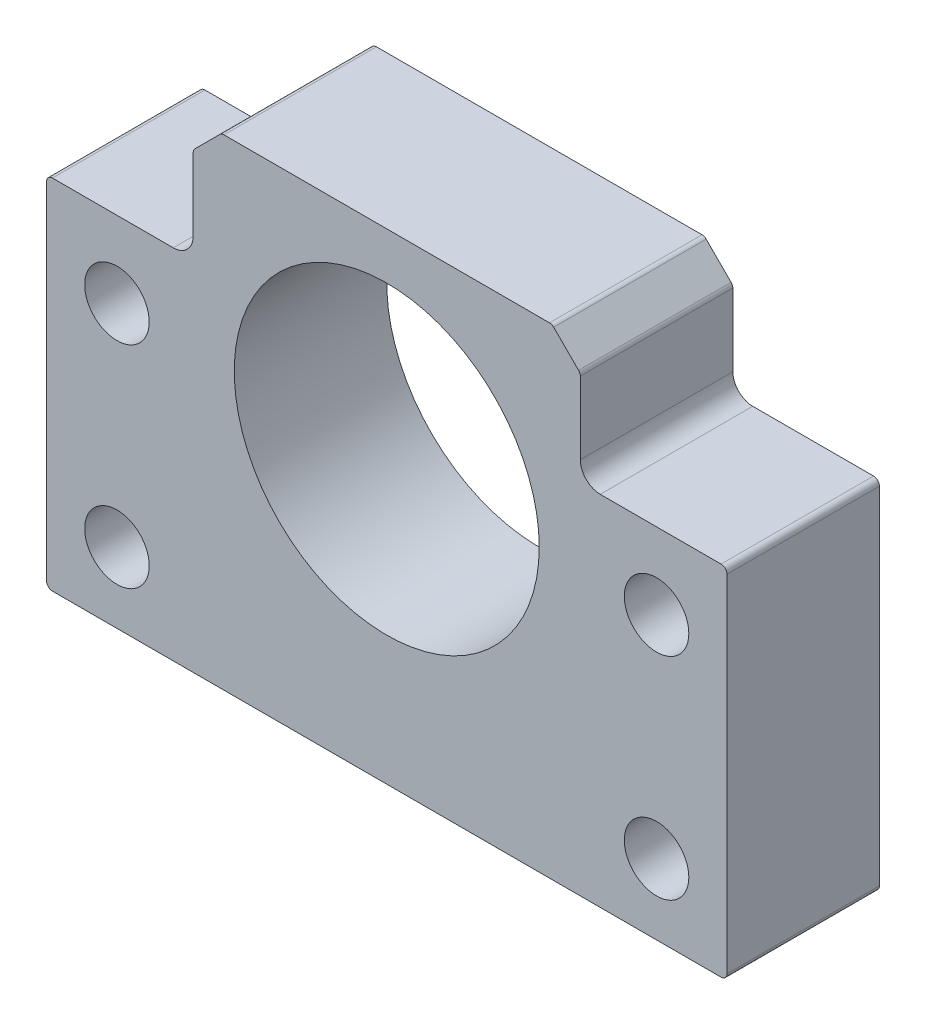
ISO-10303-21;
HEADER;
FILE_DESCRIPTION(('STEP AP214'),'2;1');
FILE_NAME('part.step','',(''),(''),'','','');
FILE_SCHEMA(('AUTOMOTIVE_DESIGN { 1 0 10303 214 1 1 1 1 }'));
ENDSEC;
DATA;
#1=APPLICATION_CONTEXT('core data for automotive mechanical design processes');
#2=APPLICATION_PROTOCOL_DEFINITION('international standard','automotive_design',2000,#1);
#3=PRODUCT_CONTEXT('',#1,'mechanical');
#4=PRODUCT('Part','Part','',(#3));
#5=PRODUCT_RELATED_PRODUCT_CATEGORY('part','',(#4));
#6=PRODUCT_DEFINITION_FORMATION('','',#4);
#7=PRODUCT_DEFINITION_CONTEXT('part definition',#1,'design');
#8=PRODUCT_DEFINITION('design','',#6,#7);
#9=PRODUCT_DEFINITION_SHAPE('','',#8);
#10=(LENGTH_UNIT() NAMED_UNIT(*) SI_UNIT(.MILLI.,.METRE.));
#11=(NAMED_UNIT(*) PLANE_ANGLE_UNIT() SI_UNIT($,.RADIAN.));
#12=(NAMED_UNIT(*) SI_UNIT($,.STERADIAN.) SOLID_ANGLE_UNIT());
#13=UNCERTAINTY_MEASURE_WITH_UNIT(LENGTH_MEASURE(1.E-05),#10,'distance_accuracy_value','');
#14=(GEOMETRIC_REPRESENTATION_CONTEXT(3) GLOBAL_UNCERTAINTY_ASSIGNED_CONTEXT((#13)) GLOBAL_UNIT_ASSIGNED_CONTEXT((#10,
#11,#12)) REPRESENTATION_CONTEXT('',''));
#15=CARTESIAN_POINT('',(0.,0.,0.));
#16=DIRECTION('',(0.,0.,1.));
#17=DIRECTION('',(1.,0.,0.));
#18=AXIS2_PLACEMENT_3D('',#15,#16,#17);
#19=CARTESIAN_POINT('',(0.,0.,13.));
#20=DIRECTION('',(0.,0.,1.));
#21=DIRECTION('',(1.,0.,0.));
#22=AXIS2_PLACEMENT_3D('',#19,#20,#21);
#23=PLANE('',#22);
#24=CARTESIAN_POINT('',(-11.9720303017953,-9.80301608638184,13.));
#25=DIRECTION('',(0.,0.,1.));
#26=DIRECTION('',(1.,0.,0.));
#27=AXIS2_PLACEMENT_3D('',#24,#25,#26);
#28=CIRCLE('',#27,2.75);
#29=CARTESIAN_POINT('',(-9.22203030179525,-9.80301608638184,13.));
#30=VERTEX_POINT('',#29);
#31=EDGE_CURVE('E658',#30,#30,#28,.T.);
#32=ORIENTED_EDGE('',*,*,#31,.F.);
#33=EDGE_LOOP('',(#32));
#34=FACE_BOUND('',#33,.T.);
#35=CARTESIAN_POINT('',(34.0279696982047,8.19698391361817,13.));
#36=DIRECTION('',(0.,0.,1.));
#37=DIRECTION('',(1.,0.,0.));
#38=AXIS2_PLACEMENT_3D('',#35,#36,#37);
#39=CIRCLE('',#38,2.74999999999999);
#40=CARTESIAN_POINT('',(36.7779696982047,8.19698391361817,13.));
#41=VERTEX_POINT('',#40);
#42=EDGE_CURVE('E343',#41,#41,#39,.T.);
#43=ORIENTED_EDGE('',*,*,#42,.F.);
#44=EDGE_LOOP('',(#43));
#45=FACE_BOUND('',#44,.T.);
#46=DIRECTION('',(-1.,0.,0.));
#47=VECTOR('',#46,1.);
#48=CARTESIAN_POINT('',(-5.47203030179526,14.6969839136182,13.));
#49=LINE('',#48,#47);
#50=CARTESIAN_POINT('',(-7.17203030179526,14.6969839136182,13.));
#51=VERTEX_POINT('',#50);
#52=CARTESIAN_POINT('',(-17.4720303017952,14.6969839136182,13.));
#53=VERTEX_POINT('',#52);
#54=EDGE_CURVE('E322',#51,#53,#49,.T.);
#55=ORIENTED_EDGE('',*,*,#54,.T.);
#56=CARTESIAN_POINT('',(-17.4720303017952,14.1969839136182,13.));
#57=DIRECTION('',(0.,0.,1.));
#58=DIRECTION('',(1.,0.,0.));
#59=AXIS2_PLACEMENT_3D('',#56,#57,#58);
#60=CIRCLE('',#59,0.5);
#61=CARTESIAN_POINT('',(-17.9720303017952,14.1969839136182,13.));
#62=VERTEX_POINT('',#61);
#63=EDGE_CURVE('E273',#53,#62,#60,.T.);
#64=ORIENTED_EDGE('',*,*,#63,.T.);
#65=DIRECTION('',(0.,-1.,0.));
#66=VECTOR('',#65,1.);
#67=CARTESIAN_POINT('',(-17.9720303017952,14.6969839136182,13.));
#68=LINE('',#67,#66);
#69=CARTESIAN_POINT('',(-17.9720303017952,-15.3030160863818,13.));
#70=VERTEX_POINT('',#69);
#71=EDGE_CURVE('E325',#62,#70,#68,.T.);
#72=ORIENTED_EDGE('',*,*,#71,.T.);
#73=CARTESIAN_POINT('',(-17.4720303017952,-15.3030160863818,13.));
#74=DIRECTION('',(0.,0.,1.));
#75=DIRECTION('',(1.,0.,0.));
#76=AXIS2_PLACEMENT_3D('',#73,#74,#75);
#77=CIRCLE('',#76,0.5);
#78=CARTESIAN_POINT('',(-17.4720303017952,-15.8030160863818,13.));
#79=VERTEX_POINT('',#78);
#80=EDGE_CURVE('E54',#70,#79,#77,.T.);
#81=ORIENTED_EDGE('',*,*,#80,.T.);
#82=DIRECTION('',(1.,0.,0.));
#83=VECTOR('',#82,1.);
#84=CARTESIAN_POINT('',(-17.9720303017952,-15.8030160863818,13.));
#85=LINE('',#84,#83);
#86=CARTESIAN_POINT('',(39.5279696982047,-15.8030160863818,13.));
#87=VERTEX_POINT('',#86);
#88=EDGE_CURVE('E193',#79,#87,#85,.T.);
#89=ORIENTED_EDGE('',*,*,#88,.T.);
#90=CARTESIAN_POINT('',(39.5279696982047,-15.3030160863818,13.));
#91=DIRECTION('',(0.,0.,1.));
#92=DIRECTION('',(1.,0.,0.));
#93=AXIS2_PLACEMENT_3D('',#90,#91,#92);
#94=CIRCLE('',#93,0.5);
#95=CARTESIAN_POINT('',(40.0279696982047,-15.3030160863818,13.));
#96=VERTEX_POINT('',#95);
#97=EDGE_CURVE('E270',#87,#96,#94,.T.);
#98=ORIENTED_EDGE('',*,*,#97,.T.);
#99=DIRECTION('',(0.,1.,0.));
#100=VECTOR('',#99,1.);
#101=CARTESIAN_POINT('',(40.0279696982047,-15.8030160863818,13.));
#102=LINE('',#101,#100);
#103=CARTESIAN_POINT('',(40.0279696982047,14.1969839136182,13.));
#104=VERTEX_POINT('',#103);
#105=EDGE_CURVE('E224',#96,#104,#102,.T.);
#106=ORIENTED_EDGE('',*,*,#105,.T.);
#107=CARTESIAN_POINT('',(39.5279696982047,14.1969839136182,13.));
#108=DIRECTION('',(0.,0.,1.));
#109=DIRECTION('',(1.,0.,0.));
#110=AXIS2_PLACEMENT_3D('',#107,#108,#109);
#111=CIRCLE('',#110,0.5);
#112=CARTESIAN_POINT('',(39.5279696982047,14.6969839136182,13.));
#113=VERTEX_POINT('',#112);
#114=EDGE_CURVE('E268',#104,#113,#111,.T.);
#115=ORIENTED_EDGE('',*,*,#114,.T.);
#116=DIRECTION('',(-1.,0.,0.));
#117=VECTOR('',#116,1.);
#118=CARTESIAN_POINT('',(40.0279696982047,14.6969839136182,13.));
#119=LINE('',#118,#117);
#120=CARTESIAN_POINT('',(29.2279696982048,14.6969839136182,13.));
#121=VERTEX_POINT('',#120);
#122=EDGE_CURVE('E351',#113,#121,#119,.T.);
#123=ORIENTED_EDGE('',*,*,#122,.T.);
#124=CARTESIAN_POINT('',(29.2279696982048,16.3969839136182,13.));
#125=DIRECTION('',(0.,0.,1.));
#126=DIRECTION('',(1.,0.,0.));
#127=AXIS2_PLACEMENT_3D('',#124,#125,#126);
#128=CIRCLE('',#127,1.7);
#129=CARTESIAN_POINT('',(27.5279696982048,16.3969839136182,13.));
#130=VERTEX_POINT('',#129);
#131=EDGE_CURVE('E182',#121,#130,#128,.F.);
#132=ORIENTED_EDGE('',*,*,#131,.T.);
#133=DIRECTION('',(0.,1.,0.));
#134=VECTOR('',#133,1.);
#135=CARTESIAN_POINT('',(27.5279696982048,14.6969839136182,13.));
#136=LINE('',#135,#134);
#137=CARTESIAN_POINT('',(27.5279696982048,22.5756635700586,13.));
#138=VERTEX_POINT('',#137);
#139=EDGE_CURVE('E192',#130,#138,#136,.T.);
#140=ORIENTED_EDGE('',*,*,#139,.T.);
#141=CARTESIAN_POINT('',(27.0279696982048,22.5756635700586,13.));
#142=DIRECTION('',(0.,0.,1.));
#143=DIRECTION('',(1.,0.,0.));
#144=AXIS2_PLACEMENT_3D('',#141,#142,#143);
#145=CIRCLE('',#144,0.5);
#146=CARTESIAN_POINT('',(27.3815230887981,22.9292169606519,13.));
#147=VERTEX_POINT('',#146);
#148=EDGE_CURVE('E266',#138,#147,#145,.T.);
#149=ORIENTED_EDGE('',*,*,#148,.T.);
#150=DIRECTION('',(-0.70710678118656,0.707106781186535,0.));
#151=VECTOR('',#150,1.);
#152=CARTESIAN_POINT('',(27.5279696982048,22.7827703512452,13.));
#153=LINE('',#152,#151);
#154=CARTESIAN_POINT('',(25.2602027452384,25.0505373042115,13.));
#155=VERTEX_POINT('',#154);
#156=EDGE_CURVE('E354',#147,#155,#153,.T.);
#157=ORIENTED_EDGE('',*,*,#156,.T.);
#158=CARTESIAN_POINT('',(24.9066493546451,24.6969839136182,13.));
#159=DIRECTION('',(0.,0.,1.));
#160=DIRECTION('',(1.,0.,0.));
#161=AXIS2_PLACEMENT_3D('',#158,#159,#160);
#162=CIRCLE('',#161,0.5);
#163=CARTESIAN_POINT('',(24.9066493546451,25.1969839136182,13.));
#164=VERTEX_POINT('',#163);
#165=EDGE_CURVE('E264',#155,#164,#162,.T.);
#166=ORIENTED_EDGE('',*,*,#165,.T.);
#167=DIRECTION('',(-1.,0.,0.));
#168=VECTOR('',#167,1.);
#169=CARTESIAN_POINT('',(25.1137561358317,25.1969839136182,13.));
#170=LINE('',#169,#168);
#171=CARTESIAN_POINT('',(-2.85070995823559,25.1969839136182,13.));
#172=VERTEX_POINT('',#171);
#173=EDGE_CURVE('E327',#164,#172,#170,.T.);
#174=ORIENTED_EDGE('',*,*,#173,.T.);
#175=CARTESIAN_POINT('',(-2.8507099582356,24.6969839136182,13.));
#176=DIRECTION('',(0.,0.,1.));
#177=DIRECTION('',(1.,0.,0.));
#178=AXIS2_PLACEMENT_3D('',#175,#176,#177);
#179=CIRCLE('',#178,0.5);
#180=CARTESIAN_POINT('',(-3.20426334882887,25.0505373042115,13.));
#181=VERTEX_POINT('',#180);
#182=EDGE_CURVE('E262',#172,#181,#179,.T.);
#183=ORIENTED_EDGE('',*,*,#182,.T.);
#184=DIRECTION('',(-0.707106781186547,-0.707106781186548,0.));
#185=VECTOR('',#184,1.);
#186=CARTESIAN_POINT('',(-3.05781673942215,25.1969839136182,13.));
#187=LINE('',#186,#185);
#188=CARTESIAN_POINT('',(-5.32558369238856,22.9292169606518,13.));
#189=VERTEX_POINT('',#188);
#190=EDGE_CURVE('E308',#181,#189,#187,.T.);
#191=ORIENTED_EDGE('',*,*,#190,.T.);
#192=CARTESIAN_POINT('',(-4.97203030179529,22.5756635700585,13.));
#193=DIRECTION('',(0.,0.,1.));
#194=DIRECTION('',(1.,0.,0.));
#195=AXIS2_PLACEMENT_3D('',#192,#193,#194);
#196=CIRCLE('',#195,0.5);
#197=CARTESIAN_POINT('',(-5.47203030179529,22.5756635700585,13.));
#198=VERTEX_POINT('',#197);
#199=EDGE_CURVE('E260',#189,#198,#196,.T.);
#200=ORIENTED_EDGE('',*,*,#199,.T.);
#201=DIRECTION('',(0.,-1.,0.));
#202=VECTOR('',#201,1.);
#203=CARTESIAN_POINT('',(-5.47203030179529,22.7827703512451,13.));
#204=LINE('',#203,#202);
#205=CARTESIAN_POINT('',(-5.47203030179526,16.3969839136182,13.));
#206=VERTEX_POINT('',#205);
#207=EDGE_CURVE('E319',#198,#206,#204,.T.);
#208=ORIENTED_EDGE('',*,*,#207,.T.);
#209=CARTESIAN_POINT('',(-7.17203030179526,16.3969839136182,13.));
#210=DIRECTION('',(0.,0.,1.));
#211=DIRECTION('',(1.,0.,0.));
#212=AXIS2_PLACEMENT_3D('',#209,#210,#211);
#213=CIRCLE('',#212,1.7);
#214=EDGE_CURVE('E236',#206,#51,#213,.F.);
#215=ORIENTED_EDGE('',*,*,#214,.T.);
#216=EDGE_LOOP('',(#55,#64,#72,#81,#89,#98,#106,#115,#123,#132,#140,#149,#157,#166,#174,#183,
#191,#200,#208,#215));
#217=FACE_BOUND('',#216,.T.);
#218=CARTESIAN_POINT('',(11.0279696982047,8.19698391361817,13.));
#219=DIRECTION('',(0.,0.,1.));
#220=DIRECTION('',(1.,0.,0.));
#221=AXIS2_PLACEMENT_3D('',#218,#219,#220);
#222=CIRCLE('',#221,13.);
#223=CARTESIAN_POINT('',(24.0279696982047,8.19698391361817,13.));
#224=VERTEX_POINT('',#223);
#225=EDGE_CURVE('E333',#224,#224,#222,.T.);
#226=ORIENTED_EDGE('',*,*,#225,.F.);
#227=EDGE_LOOP('',(#226));
#228=FACE_BOUND('',#227,.T.);
#229=CARTESIAN_POINT('',(34.0279696982047,-9.80301608638184,13.));
#230=DIRECTION('',(0.,0.,1.));
#231=DIRECTION('',(1.,0.,0.));
#232=AXIS2_PLACEMENT_3D('',#229,#230,#231);
#233=CIRCLE('',#232,2.74999999999999);
#234=CARTESIAN_POINT('',(36.7779696982047,-9.80301608638184,13.));
#235=VERTEX_POINT('',#234);
#236=EDGE_CURVE('E662',#235,#235,#233,.T.);
#237=ORIENTED_EDGE('',*,*,#236,.F.);
#238=EDGE_LOOP('',(#237));
#239=FACE_BOUND('',#238,.T.);
#240=CARTESIAN_POINT('',(-11.9720303017953,8.19698391361817,13.));
#241=DIRECTION('',(0.,0.,1.));
#242=DIRECTION('',(1.,0.,0.));
#243=AXIS2_PLACEMENT_3D('',#240,#241,#242);
#244=CIRCLE('',#243,2.75);
#245=CARTESIAN_POINT('',(-9.22203030179525,8.19698391361817,13.));
#246=VERTEX_POINT('',#245);
#247=EDGE_CURVE('E653',#246,#246,#244,.T.);
#248=ORIENTED_EDGE('',*,*,#247,.F.);
#249=EDGE_LOOP('',(#248));
#250=FACE_BOUND('',#249,.T.);
#251=ADVANCED_FACE('F32',(#34,#45,#217,#228,#239,#250),#23,.T.);
#252=CARTESIAN_POINT('',(0.,0.,0.));
#253=DIRECTION('',(0.,0.,1.));
#254=DIRECTION('',(1.,0.,0.));
#255=AXIS2_PLACEMENT_3D('',#252,#253,#254);
#256=PLANE('',#255);
#257=DIRECTION('',(0.,-1.,0.));
#258=VECTOR('',#257,1.);
#259=CARTESIAN_POINT('',(-17.9720303017952,14.6969839136182,0.));
#260=LINE('',#259,#258);
#261=CARTESIAN_POINT('',(-17.9720303017952,14.1969839136182,0.));
#262=VERTEX_POINT('',#261);
#263=CARTESIAN_POINT('',(-17.9720303017952,-15.3030160863818,0.));
#264=VERTEX_POINT('',#263);
#265=EDGE_CURVE('E220',#262,#264,#260,.T.);
#266=ORIENTED_EDGE('',*,*,#265,.F.);
#267=CARTESIAN_POINT('',(-17.4720303017952,14.1969839136182,0.));
#268=DIRECTION('',(0.,0.,1.));
#269=DIRECTION('',(1.,0.,0.));
#270=AXIS2_PLACEMENT_3D('',#267,#268,#269);
#271=CIRCLE('',#270,0.5);
#272=CARTESIAN_POINT('',(-17.4720303017952,14.6969839136182,0.));
#273=VERTEX_POINT('',#272);
#274=EDGE_CURVE('E256',#262,#273,#271,.F.);
#275=ORIENTED_EDGE('',*,*,#274,.T.);
#276=DIRECTION('',(-1.,0.,0.));
#277=VECTOR('',#276,1.);
#278=CARTESIAN_POINT('',(-5.47203030179526,14.6969839136182,0.));
#279=LINE('',#278,#277);
#280=CARTESIAN_POINT('',(-7.17203030179526,14.6969839136182,0.));
#281=VERTEX_POINT('',#280);
#282=EDGE_CURVE('E217',#281,#273,#279,.T.);
#283=ORIENTED_EDGE('',*,*,#282,.F.);
#284=CARTESIAN_POINT('',(-7.17203030179526,16.3969839136182,0.));
#285=DIRECTION('',(0.,0.,1.));
#286=DIRECTION('',(1.,0.,0.));
#287=AXIS2_PLACEMENT_3D('',#284,#285,#286);
#288=CIRCLE('',#287,1.7);
#289=CARTESIAN_POINT('',(-5.47203030179526,16.3969839136182,0.));
#290=VERTEX_POINT('',#289);
#291=EDGE_CURVE('E233',#281,#290,#288,.T.);
#292=ORIENTED_EDGE('',*,*,#291,.T.);
#293=DIRECTION('',(0.,-1.,0.));
#294=VECTOR('',#293,1.);
#295=CARTESIAN_POINT('',(-5.47203030179529,22.7827703512451,0.));
#296=LINE('',#295,#294);
#297=CARTESIAN_POINT('',(-5.47203030179529,22.5756635700585,0.));
#298=VERTEX_POINT('',#297);
#299=EDGE_CURVE('E215',#298,#290,#296,.T.);
#300=ORIENTED_EDGE('',*,*,#299,.F.);
#301=CARTESIAN_POINT('',(-4.97203030179529,22.5756635700585,0.));
#302=DIRECTION('',(0.,0.,1.));
#303=DIRECTION('',(1.,0.,0.));
#304=AXIS2_PLACEMENT_3D('',#301,#302,#303);
#305=CIRCLE('',#304,0.5);
#306=CARTESIAN_POINT('',(-5.32558369238856,22.9292169606518,0.));
#307=VERTEX_POINT('',#306);
#308=EDGE_CURVE('E243',#298,#307,#305,.F.);
#309=ORIENTED_EDGE('',*,*,#308,.T.);
#310=DIRECTION('',(-0.707106781186547,-0.707106781186548,0.));
#311=VECTOR('',#310,1.);
#312=CARTESIAN_POINT('',(-3.05781673942215,25.1969839136182,0.));
#313=LINE('',#312,#311);
#314=CARTESIAN_POINT('',(-3.20426334882887,25.0505373042115,0.));
#315=VERTEX_POINT('',#314);
#316=EDGE_CURVE('E212',#315,#307,#313,.T.);
#317=ORIENTED_EDGE('',*,*,#316,.F.);
#318=CARTESIAN_POINT('',(-2.8507099582356,24.6969839136182,0.));
#319=DIRECTION('',(0.,0.,1.));
#320=DIRECTION('',(1.,0.,0.));
#321=AXIS2_PLACEMENT_3D('',#318,#319,#320);
#322=CIRCLE('',#321,0.5);
#323=CARTESIAN_POINT('',(-2.85070995823559,25.1969839136182,0.));
#324=VERTEX_POINT('',#323);
#325=EDGE_CURVE('E245',#315,#324,#322,.F.);
#326=ORIENTED_EDGE('',*,*,#325,.T.);
#327=DIRECTION('',(-1.,0.,0.));
#328=VECTOR('',#327,1.);
#329=CARTESIAN_POINT('',(25.1137561358317,25.1969839136182,0.));
#330=LINE('',#329,#328);
#331=CARTESIAN_POINT('',(24.9066493546451,25.1969839136182,0.));
#332=VERTEX_POINT('',#331);
#333=EDGE_CURVE('E204',#332,#324,#330,.T.);
#334=ORIENTED_EDGE('',*,*,#333,.F.);
#335=CARTESIAN_POINT('',(24.9066493546451,24.6969839136182,0.));
#336=DIRECTION('',(0.,0.,1.));
#337=DIRECTION('',(1.,0.,0.));
#338=AXIS2_PLACEMENT_3D('',#335,#336,#337);
#339=CIRCLE('',#338,0.5);
#340=CARTESIAN_POINT('',(25.2602027452384,25.0505373042115,0.));
#341=VERTEX_POINT('',#340);
#342=EDGE_CURVE('E247',#332,#341,#339,.F.);
#343=ORIENTED_EDGE('',*,*,#342,.T.);
#344=DIRECTION('',(-0.70710678118656,0.707106781186535,0.));
#345=VECTOR('',#344,1.);
#346=CARTESIAN_POINT('',(27.5279696982048,22.7827703512452,0.));
#347=LINE('',#346,#345);
#348=CARTESIAN_POINT('',(27.3815230887981,22.9292169606519,0.));
#349=VERTEX_POINT('',#348);
#350=EDGE_CURVE('E200',#349,#341,#347,.T.);
#351=ORIENTED_EDGE('',*,*,#350,.F.);
#352=CARTESIAN_POINT('',(27.0279696982048,22.5756635700586,0.));
#353=DIRECTION('',(0.,0.,1.));
#354=DIRECTION('',(1.,0.,0.));
#355=AXIS2_PLACEMENT_3D('',#352,#353,#354);
#356=CIRCLE('',#355,0.5);
#357=CARTESIAN_POINT('',(27.5279696982048,22.5756635700586,0.));
#358=VERTEX_POINT('',#357);
#359=EDGE_CURVE('E199',#349,#358,#356,.F.);
#360=ORIENTED_EDGE('',*,*,#359,.T.);
#361=DIRECTION('',(0.,1.,0.));
#362=VECTOR('',#361,1.);
#363=CARTESIAN_POINT('',(27.5279696982048,14.6969839136182,0.));
#364=LINE('',#363,#362);
#365=CARTESIAN_POINT('',(27.5279696982048,16.3969839136182,0.));
#366=VERTEX_POINT('',#365);
#367=EDGE_CURVE('E189',#366,#358,#364,.T.);
#368=ORIENTED_EDGE('',*,*,#367,.F.);
#369=CARTESIAN_POINT('',(29.2279696982048,16.3969839136182,0.));
#370=DIRECTION('',(0.,0.,1.));
#371=DIRECTION('',(1.,0.,0.));
#372=AXIS2_PLACEMENT_3D('',#369,#370,#371);
#373=CIRCLE('',#372,1.7);
#374=CARTESIAN_POINT('',(29.2279696982048,14.6969839136182,0.));
#375=VERTEX_POINT('',#374);
#376=EDGE_CURVE('E172',#366,#375,#373,.T.);
#377=ORIENTED_EDGE('',*,*,#376,.T.);
#378=DIRECTION('',(-1.,0.,0.));
#379=VECTOR('',#378,1.);
#380=CARTESIAN_POINT('',(40.0279696982047,14.6969839136182,0.));
#381=LINE('',#380,#379);
#382=CARTESIAN_POINT('',(39.5279696982047,14.6969839136182,0.));
#383=VERTEX_POINT('',#382);
#384=EDGE_CURVE('E201',#383,#375,#381,.T.);
#385=ORIENTED_EDGE('',*,*,#384,.F.);
#386=CARTESIAN_POINT('',(39.5279696982047,14.1969839136182,0.));
#387=DIRECTION('',(0.,0.,1.));
#388=DIRECTION('',(1.,0.,0.));
#389=AXIS2_PLACEMENT_3D('',#386,#387,#388);
#390=CIRCLE('',#389,0.5);
#391=CARTESIAN_POINT('',(40.0279696982047,14.1969839136182,0.));
#392=VERTEX_POINT('',#391);
#393=EDGE_CURVE('E250',#383,#392,#390,.F.);
#394=ORIENTED_EDGE('',*,*,#393,.T.);
#395=DIRECTION('',(0.,1.,0.));
#396=VECTOR('',#395,1.);
#397=CARTESIAN_POINT('',(40.0279696982047,-15.8030160863818,0.));
#398=LINE('',#397,#396);
#399=CARTESIAN_POINT('',(40.0279696982047,-15.3030160863818,0.));
#400=VERTEX_POINT('',#399);
#401=EDGE_CURVE('E206',#400,#392,#398,.T.);
#402=ORIENTED_EDGE('',*,*,#401,.F.);
#403=CARTESIAN_POINT('',(39.5279696982047,-15.3030160863818,0.));
#404=DIRECTION('',(0.,0.,1.));
#405=DIRECTION('',(1.,0.,0.));
#406=AXIS2_PLACEMENT_3D('',#403,#404,#405);
#407=CIRCLE('',#406,0.5);
#408=CARTESIAN_POINT('',(39.5279696982047,-15.8030160863818,0.));
#409=VERTEX_POINT('',#408);
#410=EDGE_CURVE('E252',#400,#409,#407,.F.);
#411=ORIENTED_EDGE('',*,*,#410,.T.);
#412=DIRECTION('',(1.,0.,0.));
#413=VECTOR('',#412,1.);
#414=CARTESIAN_POINT('',(-17.9720303017952,-15.8030160863818,0.));
#415=LINE('',#414,#413);
#416=CARTESIAN_POINT('',(-17.4720303017952,-15.8030160863818,0.));
#417=VERTEX_POINT('',#416);
#418=EDGE_CURVE('E223',#417,#409,#415,.T.);
#419=ORIENTED_EDGE('',*,*,#418,.F.);
#420=CARTESIAN_POINT('',(-17.4720303017952,-15.3030160863818,0.));
#421=DIRECTION('',(0.,0.,1.));
#422=DIRECTION('',(1.,0.,0.));
#423=AXIS2_PLACEMENT_3D('',#420,#421,#422);
#424=CIRCLE('',#423,0.5);
#425=EDGE_CURVE('E254',#417,#264,#424,.F.);
#426=ORIENTED_EDGE('',*,*,#425,.T.);
#427=EDGE_LOOP('',(#266,#275,#283,#292,#300,#309,#317,#326,#334,#343,#351,#360,#368,#377,#385,
#394,#402,#411,#419,#426));
#428=FACE_BOUND('',#427,.T.);
#429=CARTESIAN_POINT('',(11.0279696982047,8.19698391361817,0.));
#430=DIRECTION('',(0.,0.,1.));
#431=DIRECTION('',(1.,0.,0.));
#432=AXIS2_PLACEMENT_3D('',#429,#430,#431);
#433=CIRCLE('',#432,13.);
#434=CARTESIAN_POINT('',(24.0279696982047,8.19698391361817,0.));
#435=VERTEX_POINT('',#434);
#436=EDGE_CURVE('E338',#435,#435,#433,.T.);
#437=ORIENTED_EDGE('',*,*,#436,.T.);
#438=EDGE_LOOP('',(#437));
#439=FACE_BOUND('',#438,.T.);
#440=CARTESIAN_POINT('',(34.0279696982047,8.19698391361817,0.));
#441=DIRECTION('',(0.,0.,1.));
#442=DIRECTION('',(1.,0.,0.));
#443=AXIS2_PLACEMENT_3D('',#440,#441,#442);
#444=CIRCLE('',#443,2.74999999999999);
#445=CARTESIAN_POINT('',(36.7779696982047,8.19698391361817,0.));
#446=VERTEX_POINT('',#445);
#447=EDGE_CURVE('E346',#446,#446,#444,.T.);
#448=ORIENTED_EDGE('',*,*,#447,.T.);
#449=EDGE_LOOP('',(#448));
#450=FACE_BOUND('',#449,.T.);
#451=CARTESIAN_POINT('',(34.0279696982047,-9.80301608638184,0.));
#452=DIRECTION('',(0.,0.,1.));
#453=DIRECTION('',(1.,0.,0.));
#454=AXIS2_PLACEMENT_3D('',#451,#452,#453);
#455=CIRCLE('',#454,2.74999999999999);
#456=CARTESIAN_POINT('',(36.7779696982047,-9.80301608638184,0.));
#457=VERTEX_POINT('',#456);
#458=EDGE_CURVE('E644',#457,#457,#455,.T.);
#459=ORIENTED_EDGE('',*,*,#458,.T.);
#460=EDGE_LOOP('',(#459));
#461=FACE_BOUND('',#460,.T.);
#462=CARTESIAN_POINT('',(-11.9720303017953,-9.80301608638184,0.));
#463=DIRECTION('',(0.,0.,1.));
#464=DIRECTION('',(1.,0.,0.));
#465=AXIS2_PLACEMENT_3D('',#462,#463,#464);
#466=CIRCLE('',#465,2.75);
#467=CARTESIAN_POINT('',(-9.22203030179525,-9.80301608638184,0.));
#468=VERTEX_POINT('',#467);
#469=EDGE_CURVE('E648',#468,#468,#466,.T.);
#470=ORIENTED_EDGE('',*,*,#469,.T.);
#471=EDGE_LOOP('',(#470));
#472=FACE_BOUND('',#471,.T.);
#473=CARTESIAN_POINT('',(-11.9720303017953,8.19698391361817,0.));
#474=DIRECTION('',(0.,0.,1.));
#475=DIRECTION('',(1.,0.,0.));
#476=AXIS2_PLACEMENT_3D('',#473,#474,#475);
#477=CIRCLE('',#476,2.75);
#478=CARTESIAN_POINT('',(-9.22203030179525,8.19698391361817,0.));
#479=VERTEX_POINT('',#478);
#480=EDGE_CURVE('E651',#479,#479,#477,.T.);
#481=ORIENTED_EDGE('',*,*,#480,.T.);
#482=EDGE_LOOP('',(#481));
#483=FACE_BOUND('',#482,.T.);
#484=ADVANCED_FACE('F196',(#428,#439,#450,#461,#472,#483),#256,.F.);
#485=CARTESIAN_POINT('',(40.0279696982047,-15.8030160863818,13.));
#486=DIRECTION('',(-1.,0.,0.));
#487=DIRECTION('',(0.,0.,1.));
#488=AXIS2_PLACEMENT_3D('',#485,#486,#487);
#489=PLANE('',#488);
#490=ORIENTED_EDGE('',*,*,#105,.F.);
#491=DIRECTION('',(0.,0.,-1.));
#492=VECTOR('',#491,1.);
#493=CARTESIAN_POINT('',(40.0279696982047,-15.3030160863818,13.));
#494=LINE('',#493,#492);
#495=EDGE_CURVE('E281',#96,#400,#494,.T.);
#496=ORIENTED_EDGE('',*,*,#495,.T.);
#497=ORIENTED_EDGE('',*,*,#401,.T.);
#498=DIRECTION('',(0.,0.,-1.));
#499=VECTOR('',#498,1.);
#500=CARTESIAN_POINT('',(40.0279696982047,14.1969839136182,13.));
#501=LINE('',#500,#499);
#502=EDGE_CURVE('E279',#392,#104,#501,.F.);
#503=ORIENTED_EDGE('',*,*,#502,.T.);
#504=EDGE_LOOP('',(#490,#496,#497,#503));
#505=FACE_BOUND('',#504,.T.);
#506=ADVANCED_FACE('F388',(#505),#489,.F.);
#507=CARTESIAN_POINT('',(40.0279696982047,14.6969839136182,13.));
#508=DIRECTION('',(0.,-1.,0.));
#509=DIRECTION('',(1.,0.,0.));
#510=AXIS2_PLACEMENT_3D('',#507,#508,#509);
#511=PLANE('',#510);
#512=ORIENTED_EDGE('',*,*,#122,.F.);
#513=DIRECTION('',(0.,0.,-1.));
#514=VECTOR('',#513,1.);
#515=CARTESIAN_POINT('',(39.5279696982047,14.6969839136182,13.));
#516=LINE('',#515,#514);
#517=EDGE_CURVE('E284',#113,#383,#516,.T.);
#518=ORIENTED_EDGE('',*,*,#517,.T.);
#519=ORIENTED_EDGE('',*,*,#384,.T.);
#520=DIRECTION('',(0.,0.,-1.));
#521=VECTOR('',#520,1.);
#522=CARTESIAN_POINT('',(29.2279696982048,14.6969839136182,13.));
#523=LINE('',#522,#521);
#524=EDGE_CURVE('E178',#375,#121,#523,.F.);
#525=ORIENTED_EDGE('',*,*,#524,.T.);
#526=EDGE_LOOP('',(#512,#518,#519,#525));
#527=FACE_BOUND('',#526,.T.);
#528=ADVANCED_FACE('F417',(#527),#511,.F.);
#529=CARTESIAN_POINT('',(27.5279696982048,14.6969839136182,13.));
#530=DIRECTION('',(-1.,0.,0.));
#531=DIRECTION('',(0.,0.,1.));
#532=AXIS2_PLACEMENT_3D('',#529,#530,#531);
#533=PLANE('',#532);
#534=ORIENTED_EDGE('',*,*,#367,.T.);
#535=DIRECTION('',(0.,0.,-1.));
#536=VECTOR('',#535,1.);
#537=CARTESIAN_POINT('',(27.5279696982048,22.5756635700586,13.));
#538=LINE('',#537,#536);
#539=EDGE_CURVE('E292',#358,#138,#538,.F.);
#540=ORIENTED_EDGE('',*,*,#539,.T.);
#541=ORIENTED_EDGE('',*,*,#139,.F.);
#542=DIRECTION('',(0.,0.,-1.));
#543=VECTOR('',#542,1.);
#544=CARTESIAN_POINT('',(27.5279696982048,16.3969839136182,0.));
#545=LINE('',#544,#543);
#546=EDGE_CURVE('E176',#130,#366,#545,.T.);
#547=ORIENTED_EDGE('',*,*,#546,.T.);
#548=EDGE_LOOP('',(#534,#540,#541,#547));
#549=FACE_BOUND('',#548,.T.);
#550=ADVANCED_FACE('F188',(#549),#533,.F.);
#551=CARTESIAN_POINT('',(27.5279696982048,22.7827703512452,13.));
#552=DIRECTION('',(-0.707106781186535,-0.70710678118656,0.));
#553=DIRECTION('',(0.70710678118656,-0.707106781186535,0.));
#554=AXIS2_PLACEMENT_3D('',#551,#552,#553);
#555=PLANE('',#554);
#556=ORIENTED_EDGE('',*,*,#156,.F.);
#557=DIRECTION('',(0.,0.,-1.));
#558=VECTOR('',#557,1.);
#559=CARTESIAN_POINT('',(27.3815230887981,22.9292169606519,13.));
#560=LINE('',#559,#558);
#561=EDGE_CURVE('E289',#147,#349,#560,.T.);
#562=ORIENTED_EDGE('',*,*,#561,.T.);
#563=ORIENTED_EDGE('',*,*,#350,.T.);
#564=DIRECTION('',(0.,0.,-1.));
#565=VECTOR('',#564,1.);
#566=CARTESIAN_POINT('',(25.2602027452384,25.0505373042115,13.));
#567=LINE('',#566,#565);
#568=EDGE_CURVE('E287',#341,#155,#567,.F.);
#569=ORIENTED_EDGE('',*,*,#568,.T.);
#570=EDGE_LOOP('',(#556,#562,#563,#569));
#571=FACE_BOUND('',#570,.T.);
#572=ADVANCED_FACE('F369',(#571),#555,.F.);
#573=CARTESIAN_POINT('',(25.1137561358317,25.1969839136182,13.));
#574=DIRECTION('',(0.,-1.,0.));
#575=DIRECTION('',(0.,0.,-1.));
#576=AXIS2_PLACEMENT_3D('',#573,#574,#575);
#577=PLANE('',#576);
#578=ORIENTED_EDGE('',*,*,#173,.F.);
#579=DIRECTION('',(0.,0.,-1.));
#580=VECTOR('',#579,1.);
#581=CARTESIAN_POINT('',(24.9066493546451,25.1969839136182,13.));
#582=LINE('',#581,#580);
#583=EDGE_CURVE('E296',#164,#332,#582,.T.);
#584=ORIENTED_EDGE('',*,*,#583,.T.);
#585=ORIENTED_EDGE('',*,*,#333,.T.);
#586=DIRECTION('',(0.,0.,-1.));
#587=VECTOR('',#586,1.);
#588=CARTESIAN_POINT('',(-2.8507099582356,25.1969839136182,13.));
#589=LINE('',#588,#587);
#590=EDGE_CURVE('E294',#324,#172,#589,.F.);
#591=ORIENTED_EDGE('',*,*,#590,.T.);
#592=EDGE_LOOP('',(#578,#584,#585,#591));
#593=FACE_BOUND('',#592,.T.);
#594=ADVANCED_FACE('F364',(#593),#577,.F.);
#595=CARTESIAN_POINT('',(-3.05781673942215,25.1969839136182,13.));
#596=DIRECTION('',(0.707106781186548,-0.707106781186547,0.));
#597=DIRECTION('',(0.707106781186547,0.707106781186548,0.));
#598=AXIS2_PLACEMENT_3D('',#595,#596,#597);
#599=PLANE('',#598);
#600=ORIENTED_EDGE('',*,*,#190,.F.);
#601=DIRECTION('',(0.,0.,-1.));
#602=VECTOR('',#601,1.);
#603=CARTESIAN_POINT('',(-3.20426334882887,25.0505373042115,13.));
#604=LINE('',#603,#602);
#605=EDGE_CURVE('E40',#181,#315,#604,.T.);
#606=ORIENTED_EDGE('',*,*,#605,.T.);
#607=ORIENTED_EDGE('',*,*,#316,.T.);
#608=DIRECTION('',(0.,0.,-1.));
#609=VECTOR('',#608,1.);
#610=CARTESIAN_POINT('',(-5.32558369238856,22.9292169606518,13.));
#611=LINE('',#610,#609);
#612=EDGE_CURVE('E299',#307,#189,#611,.F.);
#613=ORIENTED_EDGE('',*,*,#612,.T.);
#614=EDGE_LOOP('',(#600,#606,#607,#613));
#615=FACE_BOUND('',#614,.T.);
#616=ADVANCED_FACE('F305',(#615),#599,.F.);
#617=CARTESIAN_POINT('',(-5.47203030179529,22.7827703512451,13.));
#618=DIRECTION('',(1.,0.,0.));
#619=DIRECTION('',(0.,1.,0.));
#620=AXIS2_PLACEMENT_3D('',#617,#618,#619);
#621=PLANE('',#620);
#622=ORIENTED_EDGE('',*,*,#207,.F.);
#623=DIRECTION('',(0.,0.,-1.));
#624=VECTOR('',#623,1.);
#625=CARTESIAN_POINT('',(-5.47203030179529,22.5756635700585,13.));
#626=LINE('',#625,#624);
#627=EDGE_CURVE('E11',#198,#298,#626,.T.);
#628=ORIENTED_EDGE('',*,*,#627,.T.);
#629=ORIENTED_EDGE('',*,*,#299,.T.);
#630=DIRECTION('',(0.,0.,-1.));
#631=VECTOR('',#630,1.);
#632=CARTESIAN_POINT('',(-5.47203030179526,16.3969839136182,13.));
#633=LINE('',#632,#631);
#634=EDGE_CURVE('E183',#290,#206,#633,.F.);
#635=ORIENTED_EDGE('',*,*,#634,.T.);
#636=EDGE_LOOP('',(#622,#628,#629,#635));
#637=FACE_BOUND('',#636,.T.);
#638=ADVANCED_FACE('F318',(#637),#621,.F.);
#639=CARTESIAN_POINT('',(-5.47203030179526,14.6969839136182,13.));
#640=DIRECTION('',(0.,-1.,0.));
#641=DIRECTION('',(1.,0.,0.));
#642=AXIS2_PLACEMENT_3D('',#639,#640,#641);
#643=PLANE('',#642);
#644=ORIENTED_EDGE('',*,*,#282,.T.);
#645=DIRECTION('',(0.,0.,-1.));
#646=VECTOR('',#645,1.);
#647=CARTESIAN_POINT('',(-17.4720303017952,14.6969839136182,13.));
#648=LINE('',#647,#646);
#649=EDGE_CURVE('E258',#273,#53,#648,.F.);
#650=ORIENTED_EDGE('',*,*,#649,.T.);
#651=ORIENTED_EDGE('',*,*,#54,.F.);
#652=DIRECTION('',(0.,0.,-1.));
#653=VECTOR('',#652,1.);
#654=CARTESIAN_POINT('',(-7.17203030179526,14.6969839136182,0.));
#655=LINE('',#654,#653);
#656=EDGE_CURVE('E227',#51,#281,#655,.T.);
#657=ORIENTED_EDGE('',*,*,#656,.T.);
#658=EDGE_LOOP('',(#644,#650,#651,#657));
#659=FACE_BOUND('',#658,.T.);
#660=ADVANCED_FACE('F402',(#659),#643,.F.);
#661=CARTESIAN_POINT('',(-17.9720303017952,14.6969839136182,13.));
#662=DIRECTION('',(1.,0.,0.));
#663=DIRECTION('',(0.,0.,-1.));
#664=AXIS2_PLACEMENT_3D('',#661,#662,#663);
#665=PLANE('',#664);
#666=ORIENTED_EDGE('',*,*,#71,.F.);
#667=DIRECTION('',(0.,0.,-1.));
#668=VECTOR('',#667,1.);
#669=CARTESIAN_POINT('',(-17.9720303017952,14.1969839136182,13.));
#670=LINE('',#669,#668);
#671=EDGE_CURVE('E240',#62,#262,#670,.T.);
#672=ORIENTED_EDGE('',*,*,#671,.T.);
#673=ORIENTED_EDGE('',*,*,#265,.T.);
#674=DIRECTION('',(0.,0.,-1.));
#675=VECTOR('',#674,1.);
#676=CARTESIAN_POINT('',(-17.9720303017952,-15.3030160863818,13.));
#677=LINE('',#676,#675);
#678=EDGE_CURVE('E238',#264,#70,#677,.F.);
#679=ORIENTED_EDGE('',*,*,#678,.T.);
#680=EDGE_LOOP('',(#666,#672,#673,#679));
#681=FACE_BOUND('',#680,.T.);
#682=ADVANCED_FACE('F399',(#681),#665,.F.);
#683=CARTESIAN_POINT('',(-17.9720303017952,-15.8030160863818,13.));
#684=DIRECTION('',(0.,1.,0.));
#685=DIRECTION('',(0.,0.,1.));
#686=AXIS2_PLACEMENT_3D('',#683,#684,#685);
#687=PLANE('',#686);
#688=ORIENTED_EDGE('',*,*,#88,.F.);
#689=DIRECTION('',(0.,0.,-1.));
#690=VECTOR('',#689,1.);
#691=CARTESIAN_POINT('',(-17.4720303017952,-15.8030160863818,13.));
#692=LINE('',#691,#690);
#693=EDGE_CURVE('E276',#79,#417,#692,.T.);
#694=ORIENTED_EDGE('',*,*,#693,.T.);
#695=ORIENTED_EDGE('',*,*,#418,.T.);
#696=DIRECTION('',(0.,0.,-1.));
#697=VECTOR('',#696,1.);
#698=CARTESIAN_POINT('',(39.5279696982047,-15.8030160863818,13.));
#699=LINE('',#698,#697);
#700=EDGE_CURVE('E47',#409,#87,#699,.F.);
#701=ORIENTED_EDGE('',*,*,#700,.T.);
#702=EDGE_LOOP('',(#688,#694,#695,#701));
#703=FACE_BOUND('',#702,.T.);
#704=ADVANCED_FACE('F396',(#703),#687,.F.);
#705=CARTESIAN_POINT('',(11.0279696982047,8.19698391361817,13.));
#706=DIRECTION('',(0.,0.,-1.));
#707=DIRECTION('',(-1.,0.,0.));
#708=AXIS2_PLACEMENT_3D('',#705,#706,#707);
#709=CYLINDRICAL_SURFACE('',#708,13.);
#710=ORIENTED_EDGE('',*,*,#225,.T.);
#711=EDGE_LOOP('',(#710));
#712=FACE_BOUND('',#711,.T.);
#713=ORIENTED_EDGE('',*,*,#436,.F.);
#714=EDGE_LOOP('',(#713));
#715=FACE_BOUND('',#714,.T.);
#716=ADVANCED_FACE('F393',(#712,#715),#709,.F.);
#717=CARTESIAN_POINT('',(34.0279696982047,8.19698391361817,13.));
#718=DIRECTION('',(0.,0.,-1.));
#719=DIRECTION('',(-1.,0.,0.));
#720=AXIS2_PLACEMENT_3D('',#717,#718,#719);
#721=CYLINDRICAL_SURFACE('',#720,2.74999999999999);
#722=ORIENTED_EDGE('',*,*,#42,.T.);
#723=EDGE_LOOP('',(#722));
#724=FACE_BOUND('',#723,.T.);
#725=ORIENTED_EDGE('',*,*,#447,.F.);
#726=EDGE_LOOP('',(#725));
#727=FACE_BOUND('',#726,.T.);
#728=ADVANCED_FACE('F541',(#724,#727),#721,.F.);
#729=CARTESIAN_POINT('',(34.0279696982047,-9.80301608638184,13.));
#730=DIRECTION('',(0.,0.,-1.));
#731=DIRECTION('',(-1.,0.,0.));
#732=AXIS2_PLACEMENT_3D('',#729,#730,#731);
#733=CYLINDRICAL_SURFACE('',#732,2.74999999999999);
#734=ORIENTED_EDGE('',*,*,#236,.T.);
#735=EDGE_LOOP('',(#734));
#736=FACE_BOUND('',#735,.T.);
#737=ORIENTED_EDGE('',*,*,#458,.F.);
#738=EDGE_LOOP('',(#737));
#739=FACE_BOUND('',#738,.T.);
#740=ADVANCED_FACE('F532',(#736,#739),#733,.F.);
#741=CARTESIAN_POINT('',(-11.9720303017953,-9.80301608638184,13.));
#742=DIRECTION('',(0.,0.,-1.));
#743=DIRECTION('',(-1.,0.,0.));
#744=AXIS2_PLACEMENT_3D('',#741,#742,#743);
#745=CYLINDRICAL_SURFACE('',#744,2.75);
#746=ORIENTED_EDGE('',*,*,#31,.T.);
#747=EDGE_LOOP('',(#746));
#748=FACE_BOUND('',#747,.T.);
#749=ORIENTED_EDGE('',*,*,#469,.F.);
#750=EDGE_LOOP('',(#749));
#751=FACE_BOUND('',#750,.T.);
#752=ADVANCED_FACE('F523',(#748,#751),#745,.F.);
#753=CARTESIAN_POINT('',(-11.9720303017953,8.19698391361817,13.));
#754=DIRECTION('',(0.,0.,-1.));
#755=DIRECTION('',(-1.,0.,0.));
#756=AXIS2_PLACEMENT_3D('',#753,#754,#755);
#757=CYLINDRICAL_SURFACE('',#756,2.75);
#758=ORIENTED_EDGE('',*,*,#247,.T.);
#759=EDGE_LOOP('',(#758));
#760=FACE_BOUND('',#759,.T.);
#761=ORIENTED_EDGE('',*,*,#480,.F.);
#762=EDGE_LOOP('',(#761));
#763=FACE_BOUND('',#762,.T.);
#764=ADVANCED_FACE('F426',(#760,#763),#757,.F.);
#765=CARTESIAN_POINT('',(29.2279696982048,16.3969839136182,13.));
#766=DIRECTION('',(0.,0.,1.));
#767=DIRECTION('',(1.,0.,0.));
#768=AXIS2_PLACEMENT_3D('',#765,#766,#767);
#769=CYLINDRICAL_SURFACE('',#768,1.7);
#770=ORIENTED_EDGE('',*,*,#131,.F.);
#771=ORIENTED_EDGE('',*,*,#524,.F.);
#772=ORIENTED_EDGE('',*,*,#376,.F.);
#773=ORIENTED_EDGE('',*,*,#546,.F.);
#774=EDGE_LOOP('',(#770,#771,#772,#773));
#775=FACE_BOUND('',#774,.T.);
#776=ADVANCED_FACE('F175',(#775),#769,.F.);
#777=CARTESIAN_POINT('',(-7.17203030179526,16.3969839136182,13.));
#778=DIRECTION('',(0.,0.,1.));
#779=DIRECTION('',(1.,0.,0.));
#780=AXIS2_PLACEMENT_3D('',#777,#778,#779);
#781=CYLINDRICAL_SURFACE('',#780,1.7);
#782=ORIENTED_EDGE('',*,*,#214,.F.);
#783=ORIENTED_EDGE('',*,*,#634,.F.);
#784=ORIENTED_EDGE('',*,*,#291,.F.);
#785=ORIENTED_EDGE('',*,*,#656,.F.);
#786=EDGE_LOOP('',(#782,#783,#784,#785));
#787=FACE_BOUND('',#786,.T.);
#788=ADVANCED_FACE('F425',(#787),#781,.F.);
#789=CARTESIAN_POINT('',(-17.4720303017952,14.1969839136182,13.));
#790=DIRECTION('',(0.,0.,-1.));
#791=DIRECTION('',(-1.,0.,0.));
#792=AXIS2_PLACEMENT_3D('',#789,#790,#791);
#793=CYLINDRICAL_SURFACE('',#792,0.5);
#794=ORIENTED_EDGE('',*,*,#63,.F.);
#795=ORIENTED_EDGE('',*,*,#649,.F.);
#796=ORIENTED_EDGE('',*,*,#274,.F.);
#797=ORIENTED_EDGE('',*,*,#671,.F.);
#798=EDGE_LOOP('',(#794,#795,#796,#797));
#799=FACE_BOUND('',#798,.T.);
#800=ADVANCED_FACE('F429',(#799),#793,.T.);
#801=CARTESIAN_POINT('',(-17.4720303017952,-15.3030160863818,13.));
#802=DIRECTION('',(0.,0.,-1.));
#803=DIRECTION('',(-1.,0.,0.));
#804=AXIS2_PLACEMENT_3D('',#801,#802,#803);
#805=CYLINDRICAL_SURFACE('',#804,0.5);
#806=ORIENTED_EDGE('',*,*,#80,.F.);
#807=ORIENTED_EDGE('',*,*,#678,.F.);
#808=ORIENTED_EDGE('',*,*,#425,.F.);
#809=ORIENTED_EDGE('',*,*,#693,.F.);
#810=EDGE_LOOP('',(#806,#807,#808,#809));
#811=FACE_BOUND('',#810,.T.);
#812=ADVANCED_FACE('F433',(#811),#805,.T.);
#813=CARTESIAN_POINT('',(39.5279696982047,-15.3030160863818,13.));
#814=DIRECTION('',(0.,0.,-1.));
#815=DIRECTION('',(-1.,0.,0.));
#816=AXIS2_PLACEMENT_3D('',#813,#814,#815);
#817=CYLINDRICAL_SURFACE('',#816,0.5);
#818=ORIENTED_EDGE('',*,*,#97,.F.);
#819=ORIENTED_EDGE('',*,*,#700,.F.);
#820=ORIENTED_EDGE('',*,*,#410,.F.);
#821=ORIENTED_EDGE('',*,*,#495,.F.);
#822=EDGE_LOOP('',(#818,#819,#820,#821));
#823=FACE_BOUND('',#822,.T.);
#824=ADVANCED_FACE('F437',(#823),#817,.T.);
#825=CARTESIAN_POINT('',(39.5279696982047,14.1969839136182,13.));
#826=DIRECTION('',(0.,0.,-1.));
#827=DIRECTION('',(-1.,0.,0.));
#828=AXIS2_PLACEMENT_3D('',#825,#826,#827);
#829=CYLINDRICAL_SURFACE('',#828,0.5);
#830=ORIENTED_EDGE('',*,*,#114,.F.);
#831=ORIENTED_EDGE('',*,*,#502,.F.);
#832=ORIENTED_EDGE('',*,*,#393,.F.);
#833=ORIENTED_EDGE('',*,*,#517,.F.);
#834=EDGE_LOOP('',(#830,#831,#832,#833));
#835=FACE_BOUND('',#834,.T.);
#836=ADVANCED_FACE('F379',(#835),#829,.T.);
#837=CARTESIAN_POINT('',(27.0279696982048,22.5756635700586,13.));
#838=DIRECTION('',(0.,0.,-1.));
#839=DIRECTION('',(-1.,0.,0.));
#840=AXIS2_PLACEMENT_3D('',#837,#838,#839);
#841=CYLINDRICAL_SURFACE('',#840,0.5);
#842=ORIENTED_EDGE('',*,*,#148,.F.);
#843=ORIENTED_EDGE('',*,*,#539,.F.);
#844=ORIENTED_EDGE('',*,*,#359,.F.);
#845=ORIENTED_EDGE('',*,*,#561,.F.);
#846=EDGE_LOOP('',(#842,#843,#844,#845));
#847=FACE_BOUND('',#846,.T.);
#848=ADVANCED_FACE('F373',(#847),#841,.T.);
#849=CARTESIAN_POINT('',(24.9066493546451,24.6969839136182,13.));
#850=DIRECTION('',(0.,0.,-1.));
#851=DIRECTION('',(-1.,0.,0.));
#852=AXIS2_PLACEMENT_3D('',#849,#850,#851);
#853=CYLINDRICAL_SURFACE('',#852,0.5);
#854=ORIENTED_EDGE('',*,*,#165,.F.);
#855=ORIENTED_EDGE('',*,*,#568,.F.);
#856=ORIENTED_EDGE('',*,*,#342,.F.);
#857=ORIENTED_EDGE('',*,*,#583,.F.);
#858=EDGE_LOOP('',(#854,#855,#856,#857));
#859=FACE_BOUND('',#858,.T.);
#860=ADVANCED_FACE('F371',(#859),#853,.T.);
#861=CARTESIAN_POINT('',(-2.8507099582356,24.6969839136182,13.));
#862=DIRECTION('',(0.,0.,-1.));
#863=DIRECTION('',(-1.,0.,0.));
#864=AXIS2_PLACEMENT_3D('',#861,#862,#863);
#865=CYLINDRICAL_SURFACE('',#864,0.5);
#866=ORIENTED_EDGE('',*,*,#182,.F.);
#867=ORIENTED_EDGE('',*,*,#590,.F.);
#868=ORIENTED_EDGE('',*,*,#325,.F.);
#869=ORIENTED_EDGE('',*,*,#605,.F.);
#870=EDGE_LOOP('',(#866,#867,#868,#869));
#871=FACE_BOUND('',#870,.T.);
#872=ADVANCED_FACE('F363',(#871),#865,.T.);
#873=CARTESIAN_POINT('',(-4.97203030179529,22.5756635700585,13.));
#874=DIRECTION('',(0.,0.,-1.));
#875=DIRECTION('',(-1.,0.,0.));
#876=AXIS2_PLACEMENT_3D('',#873,#874,#875);
#877=CYLINDRICAL_SURFACE('',#876,0.5);
#878=ORIENTED_EDGE('',*,*,#199,.F.);
#879=ORIENTED_EDGE('',*,*,#612,.F.);
#880=ORIENTED_EDGE('',*,*,#308,.F.);
#881=ORIENTED_EDGE('',*,*,#627,.F.);
#882=EDGE_LOOP('',(#878,#879,#880,#881));
#883=FACE_BOUND('',#882,.T.);
#884=ADVANCED_FACE('F34',(#883),#877,.T.);
#885=CLOSED_SHELL('',(#251,#484,#506,#528,#550,#572,#594,#616,#638,#660,#682,#704,#716,#728,
#740,#752,#764,#776,#788,#800,#812,#824,#836,#848,#860,#872,#884));
#886=MANIFOLD_SOLID_BREP('B2',#885);
#887=ADVANCED_BREP_SHAPE_REPRESENTATION('',(#18,#886),#14);
#888=SHAPE_DEFINITION_REPRESENTATION(#9,#887);
ENDSEC;
END-ISO-10303-21;
